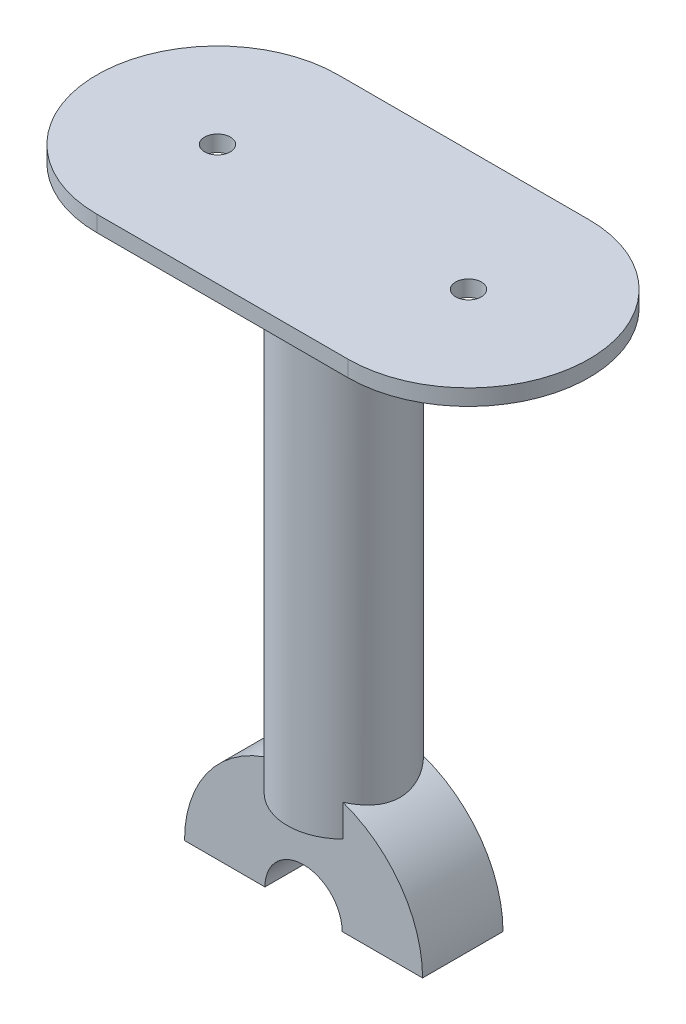
ISO-10303-21;
HEADER;
FILE_DESCRIPTION(('STEP AP214'),'2;1');
FILE_NAME('part.step','',(''),(''),'','','');
FILE_SCHEMA(('AUTOMOTIVE_DESIGN { 1 0 10303 214 1 1 1 1 }'));
ENDSEC;
DATA;
#1=APPLICATION_CONTEXT('core data for automotive mechanical design processes');
#2=APPLICATION_PROTOCOL_DEFINITION('international standard','automotive_design',2000,#1);
#3=PRODUCT_CONTEXT('',#1,'mechanical');
#4=PRODUCT('Part','Part','',(#3));
#5=PRODUCT_RELATED_PRODUCT_CATEGORY('part','',(#4));
#6=PRODUCT_DEFINITION_FORMATION('','',#4);
#7=PRODUCT_DEFINITION_CONTEXT('part definition',#1,'design');
#8=PRODUCT_DEFINITION('design','',#6,#7);
#9=PRODUCT_DEFINITION_SHAPE('','',#8);
#10=(LENGTH_UNIT() NAMED_UNIT(*) SI_UNIT(.MILLI.,.METRE.));
#11=(NAMED_UNIT(*) PLANE_ANGLE_UNIT() SI_UNIT($,.RADIAN.));
#12=(NAMED_UNIT(*) SI_UNIT($,.STERADIAN.) SOLID_ANGLE_UNIT());
#13=UNCERTAINTY_MEASURE_WITH_UNIT(LENGTH_MEASURE(1.E-05),#10,'distance_accuracy_value','');
#14=(GEOMETRIC_REPRESENTATION_CONTEXT(3) GLOBAL_UNCERTAINTY_ASSIGNED_CONTEXT((#13)) GLOBAL_UNIT_ASSIGNED_CONTEXT((#10,
#11,#12)) REPRESENTATION_CONTEXT('',''));
#15=CARTESIAN_POINT('',(0.,0.,0.));
#16=DIRECTION('',(0.,0.,1.));
#17=DIRECTION('',(1.,0.,0.));
#18=AXIS2_PLACEMENT_3D('',#15,#16,#17);
#19=CARTESIAN_POINT('',(0.,0.,3.3975023503956));
#20=DIRECTION('',(0.,0.,1.));
#21=DIRECTION('',(1.,0.,0.));
#22=AXIS2_PLACEMENT_3D('',#19,#20,#21);
#23=CYLINDRICAL_SURFACE('',#22,14.8);
#24=CARTESIAN_POINT('',(0.,14.8,-12.));
#25=CARTESIAN_POINT('',(-0.185259704840457,14.7999989630347,-11.9999988078874));
#26=CARTESIAN_POINT('',(-0.370549644482239,14.7965128172788,-11.9926363795848));
#27=CARTESIAN_POINT('',(-0.739780227980245,14.7826549803144,-11.9632644366915));
#28=CARTESIAN_POINT('',(-0.923720145121212,14.7722798214526,-11.9412475456179));
#29=CARTESIAN_POINT('',(-1.28910114819417,14.7448918264912,-11.8827685865555));
#30=CARTESIAN_POINT('',(-1.47053758174263,14.7278680058336,-11.8462826119881));
#31=CARTESIAN_POINT('',(-1.82937356041451,14.6876140820812,-11.7592525286429));
#32=CARTESIAN_POINT('',(-2.00677142159427,14.6643814397579,-11.708702667794));
#33=CARTESIAN_POINT('',(-2.35554842079048,14.6124040073616,-11.5943107568344));
#34=CARTESIAN_POINT('',(-2.52694967113428,14.5836827315042,-11.5305253135513));
#35=CARTESIAN_POINT('',(-2.86354637851544,14.5213435070958,-11.3900997622016));
#36=CARTESIAN_POINT('',(-3.02873944521919,14.4877236962773,-11.3134547636537));
#37=CARTESIAN_POINT('',(-3.35186725515679,14.4163912039918,-11.1480001335724));
#38=CARTESIAN_POINT('',(-3.5098062825915,14.3786809837213,-11.0591978087535));
#39=CARTESIAN_POINT('',(-3.81777509910112,14.2999966554203,-10.8700331437742));
#40=CARTESIAN_POINT('',(-3.96780197084138,14.2590213572953,-10.7696665825435));
#41=CARTESIAN_POINT('',(-4.42108547304645,14.1278535195382,-10.4404371870597));
#42=CARTESIAN_POINT('',(-4.70964202390827,14.0335008825378,-10.1925720917923));
#43=CARTESIAN_POINT('',(-5.24283721455753,13.8431588409943,-9.65365343628107));
#44=CARTESIAN_POINT('',(-5.48744611884268,13.7471683760043,-9.36257087598792));
#45=CARTESIAN_POINT('',(-5.82475173433462,13.6061938897523,-8.88760350986094));
#46=CARTESIAN_POINT('',(-5.93514734612753,13.5582725670511,-8.71691852029386));
#47=CARTESIAN_POINT('',(-6.14104637311898,13.4662634191195,-8.3658454378063));
#48=CARTESIAN_POINT('',(-6.23655599014154,13.4221740008407,-8.18546142806089));
#49=CARTESIAN_POINT('',(-6.41182410543168,13.3393371851367,-7.81607845411402));
#50=CARTESIAN_POINT('',(-6.49158683965586,13.3005883519278,-7.62708182361596));
#51=CARTESIAN_POINT('',(-6.63453517011881,13.2298643578488,-7.24168814298956));
#52=CARTESIAN_POINT('',(-6.69772240141591,13.1978885289289,-7.04529182497641));
#53=CARTESIAN_POINT('',(-6.80363014977447,13.1435899965697,-6.6578981416711));
#54=CARTESIAN_POINT('',(-6.84730684606449,13.1208232778415,-6.46722459989281));
#55=CARTESIAN_POINT('',(-6.91862500638124,13.0833580724292,-6.08211261486596));
#56=CARTESIAN_POINT('',(-6.94626708974332,13.0686592741237,-5.88767431733053));
#57=CARTESIAN_POINT('',(-6.98510508964963,13.0479421356164,-5.49683614394285));
#58=CARTESIAN_POINT('',(-6.99631248603065,13.0419177362905,-5.30043773389249));
#59=CARTESIAN_POINT('',(-7.00214572225295,13.0387871585309,-4.90733086862232));
#60=CARTESIAN_POINT('',(-6.99677286734342,13.0416802780822,-4.71062243902669));
#61=CARTESIAN_POINT('',(-6.97096031164226,13.0554926702048,-4.33919417542183));
#62=CARTESIAN_POINT('',(-6.9521542769814,13.0655413454779,-4.16432523842649));
#63=CARTESIAN_POINT('',(-6.90153548715552,13.0923500055375,-3.81694250570035));
#64=CARTESIAN_POINT('',(-6.86971837201076,13.1091122399819,-3.64442951948722));
#65=CARTESIAN_POINT('',(-6.79343463056445,13.1488056140694,-3.30298960068545));
#66=CARTESIAN_POINT('',(-6.74897022127037,13.1717356724857,-3.13406204516105));
#67=CARTESIAN_POINT('',(-6.64781516248701,13.2230771017056,-2.80070224333293));
#68=CARTESIAN_POINT('',(-6.59111974035983,13.2514906117379,-2.63627178013216));
#69=CARTESIAN_POINT('',(-6.46458165910964,13.313687033113,-2.30915837492915));
#70=CARTESIAN_POINT('',(-6.39446942641236,13.3475773221095,-2.1466001326302));
#71=CARTESIAN_POINT('',(-6.24252885164101,13.4193103288737,-1.8279310443375));
#72=CARTESIAN_POINT('',(-6.16069629259148,13.4571544679056,-1.67182254512356));
#73=CARTESIAN_POINT('',(-5.89845915900736,13.575158860251,-1.21427645218861));
#74=CARTESIAN_POINT('',(-5.70125153305051,13.6598236968513,-0.923455164811159));
#75=CARTESIAN_POINT('',(-5.24193138118177,13.8430376844787,-0.344519140329213));
#76=CARTESIAN_POINT('',(-4.97502570915163,13.9420804367857,-0.0603476578295819));
#77=CARTESIAN_POINT('',(-4.54160727118243,14.0867723595959,0.330268088341862));
#78=CARTESIAN_POINT('',(-4.39150615898713,14.1343900546379,0.454608664487689));
#79=CARTESIAN_POINT('',(-4.08098600740394,14.227148629405,0.690653850171055));
#80=CARTESIAN_POINT('',(-3.92057089935424,14.2722904408357,0.802363230017638));
#81=CARTESIAN_POINT('',(-3.58395625792121,14.3605947583672,1.01635617143752));
#82=CARTESIAN_POINT('',(-3.40738824743011,14.4036163996377,1.11811869917526));
#83=CARTESIAN_POINT('',(-3.04518362570229,14.4845181237175,1.30622499528433));
#84=CARTESIAN_POINT('',(-2.85955109139582,14.5224004895622,1.3925756155484));
#85=CARTESIAN_POINT('',(-2.48048120991425,14.5919268270289,1.54898746790261));
#86=CARTESIAN_POINT('',(-2.28704648066603,14.6235728705344,1.61905411138431));
#87=CARTESIAN_POINT('',(-1.89380541459821,14.6796774173357,1.74210143117157));
#88=CARTESIAN_POINT('',(-1.69399972612603,14.7041366494336,1.79508384001281));
#89=CARTESIAN_POINT('',(-1.30521960968256,14.7435275108898,1.87989090311255));
#90=CARTESIAN_POINT('',(-1.11658990190083,14.7590460289318,1.91302669572357));
#91=CARTESIAN_POINT('',(-0.736800389157911,14.7828723994646,1.96375046721015));
#92=CARTESIAN_POINT('',(-0.545640712884827,14.7911806172906,1.98133923383146));
#93=CARTESIAN_POINT('',(-0.162410266541905,14.8003496543467,2.00074443829371));
#94=CARTESIAN_POINT('',(0.0296601689564953,14.801213024033,2.0025662775699));
#95=CARTESIAN_POINT('',(0.413185719212609,14.7954740797575,1.99042795238675));
#96=CARTESIAN_POINT('',(0.604640855696791,14.788872032373,1.97646835145566));
#97=CARTESIAN_POINT('',(0.972420217459925,14.7690887268991,1.93442834038498));
#98=CARTESIAN_POINT('',(1.1488885326074,14.7563850561395,1.90737199417242));
#99=CARTESIAN_POINT('',(1.49878817928972,14.7249617250434,1.83998440742076));
#100=CARTESIAN_POINT('',(1.67221844894574,14.7062400037973,1.79964861915979));
#101=CARTESIAN_POINT('',(2.01480503443777,14.6632315243743,1.70612265973108));
#102=CARTESIAN_POINT('',(2.18396265700001,14.6389464911064,1.65293647256018));
#103=CARTESIAN_POINT('',(2.51711462852746,14.5853562784322,1.5341736113086));
#104=CARTESIAN_POINT('',(2.68110697506175,14.5560491797933,1.46859219927828));
#105=CARTESIAN_POINT('',(3.00780345594292,14.4921232525648,1.32344929361286));
#106=CARTESIAN_POINT('',(3.17032179681788,14.4573715910148,1.24352782376027));
#107=CARTESIAN_POINT('',(3.48804912220733,14.3840239497267,1.07175117127925));
#108=CARTESIAN_POINT('',(3.64325540167751,14.3454265634853,0.979891618749943));
#109=CARTESIAN_POINT('',(4.0967213269167,14.2251348800562,0.687370255837105));
#110=CARTESIAN_POINT('',(4.38300194347983,14.138905638486,0.469687926734008));
#111=CARTESIAN_POINT('',(4.94225095005662,13.9538036899958,-0.0274327139034795));
#112=CARTESIAN_POINT('',(5.21171346959498,13.8544910374497,-0.310661962509478));
#113=CARTESIAN_POINT('',(5.57824385907027,13.7091421904583,-0.766637573959796));
#114=CARTESIAN_POINT('',(5.69421902694836,13.6612600566409,-0.923952733700806));
#115=CARTESIAN_POINT('',(5.91290438663517,13.5680382465226,-1.24823236736146));
#116=CARTESIAN_POINT('',(6.01561967821008,13.5226975965824,-1.41519309560532));
#117=CARTESIAN_POINT('',(6.21048288197348,13.4343503020569,-1.76406895133246));
#118=CARTESIAN_POINT('',(6.30212015157853,13.3914855389934,-1.94630557738623));
#119=CARTESIAN_POINT('',(6.4694853232005,13.3114374021792,-2.31905462436036));
#120=CARTESIAN_POINT('',(6.54522081779358,13.2742513193684,-2.50956304309341));
#121=CARTESIAN_POINT('',(6.67993927484684,13.2069710941444,-2.89749230793815));
#122=CARTESIAN_POINT('',(6.73893386126238,13.1768720333819,-3.09490825033542));
#123=CARTESIAN_POINT('',(6.83945551613644,13.1249785084288,-3.49520290686643));
#124=CARTESIAN_POINT('',(6.88098492844879,13.1031829299348,-3.69808088409574));
#125=CARTESIAN_POINT('',(6.94298704812643,13.0704261310285,-4.08874111227443));
#126=CARTESIAN_POINT('',(6.96503875587765,13.0586560415743,-4.27620606638296));
#127=CARTESIAN_POINT('',(6.99392320526031,13.04320942762,-4.65263522990118));
#128=CARTESIAN_POINT('',(7.00075692046395,13.0395323853668,-4.84159934262585));
#129=CARTESIAN_POINT('',(6.99911023654371,13.0404162262943,-5.21938907412436));
#130=CARTESIAN_POINT('',(6.99063385236957,13.0449749497121,-5.4082147162204));
#131=CARTESIAN_POINT('',(6.95849384073578,13.0621473852668,-5.78419318444977));
#132=CARTESIAN_POINT('',(6.93483061754902,13.0747608829859,-5.97134605497774));
#133=CARTESIAN_POINT('',(6.87504100343548,13.1062905671937,-6.32814411931347));
#134=CARTESIAN_POINT('',(6.84001741008548,13.1246452102974,-6.4980257786748));
#135=CARTESIAN_POINT('',(6.75766781571394,13.1672348386201,-6.83408413898016));
#136=CARTESIAN_POINT('',(6.71033766550797,13.1914718068948,-7.00025956980447));
#137=CARTESIAN_POINT('',(6.60383646966391,13.2451082880741,-7.32787710765511));
#138=CARTESIAN_POINT('',(6.54466716670065,13.2745070411071,-7.4893199073003));
#139=CARTESIAN_POINT('',(6.41495012628098,13.3376766276556,-7.8067465222685));
#140=CARTESIAN_POINT('',(6.34439799972798,13.371449146654,-7.96272820349336));
#141=CARTESIAN_POINT('',(6.18739464300475,13.4448556643011,-8.27860988688189));
#142=CARTESIAN_POINT('',(6.10019956304822,13.4847297968752,-8.43808437361797));
#143=CARTESIAN_POINT('',(5.91403671000074,13.5674073973668,-8.74927444460269));
#144=CARTESIAN_POINT('',(5.81506491386426,13.6102118641833,-8.90098735196303));
#145=CARTESIAN_POINT('',(5.60593047666166,13.6976782829684,-9.19597901155181));
#146=CARTESIAN_POINT('',(5.49576522579768,13.7423406666773,-9.33925578450645));
#147=CARTESIAN_POINT('',(5.26482668901307,13.8324605410203,-9.61672889856401));
#148=CARTESIAN_POINT('',(5.14405272594405,13.8779180822602,-9.75092465906151));
#149=CARTESIAN_POINT('',(4.87930107808523,13.9733399221026,-10.0231601234033));
#150=CARTESIAN_POINT('',(4.7342174988006,14.0232787383807,-10.160135919027));
#151=CARTESIAN_POINT('',(4.43261818282592,14.1215098305543,-10.4214104513931));
#152=CARTESIAN_POINT('',(4.27610599952954,14.1698026114447,-10.5457130999231));
#153=CARTESIAN_POINT('',(3.9522872628702,14.263514893461,-10.7809609197232));
#154=CARTESIAN_POINT('',(3.78497071502903,14.3089316549661,-10.8918934431681));
#155=CARTESIAN_POINT('',(3.44069851295201,14.3955924522272,-11.0993410312224));
#156=CARTESIAN_POINT('',(3.26374735537594,14.4368384093278,-11.1958627442449));
#157=CARTESIAN_POINT('',(2.9017273737336,14.5139287938707,-11.3734221078129));
#158=CARTESIAN_POINT('',(2.71668226597695,14.5497877946334,-11.4545016992707));
#159=CARTESIAN_POINT('',(2.33937726051128,14.6151956972959,-11.6006222787515));
#160=CARTESIAN_POINT('',(2.14712093222852,14.6447476738377,-11.6656710841048));
#161=CARTESIAN_POINT('',(1.75723410973888,14.6966226401365,-11.7788821591968));
#162=CARTESIAN_POINT('',(1.55961707124085,14.7189621886985,-11.8270831307387));
#163=CARTESIAN_POINT('',(1.1603268997815,14.7558050682433,-11.9061577409497));
#164=CARTESIAN_POINT('',(0.958656504004277,14.770313514511,-11.9370426909755));
#165=CARTESIAN_POINT('',(0.63047291275654,14.7870990433377,-11.97269164032));
#166=CARTESIAN_POINT('',(0.504655240627097,14.7919310409209,-11.982926249091));
#167=CARTESIAN_POINT('',(0.252563069003192,14.7983819082822,-11.9965809107315));
#168=CARTESIAN_POINT('',(0.126288559451097,14.8000007068825,-12.0000008126439));
#169=CARTESIAN_POINT('',(0.,14.8,-12.));
#170=B_SPLINE_CURVE_WITH_KNOTS('',3,(#24,#25,#26,#27,#28,#29,#30,#31,#32,#33,#34,#35,#36,#37,
#38,#39,#40,#41,#42,#43,#44,#45,#46,#47,#48,#49,#50,#51,#52,#53,#54,#55,#56,#57,#58,#59,#60,#61,
#62,#63,#64,#65,#66,#67,#68,#69,#70,#71,#72,#73,#74,#75,#76,#77,#78,#79,#80,#81,#82,#83,#84,#85,
#86,#87,#88,#89,#90,#91,#92,#93,#94,#95,#96,#97,#98,#99,#100,#101,#102,#103,#104,#105,#106,#107,
#108,#109,#110,#111,#112,#113,#114,#115,#116,#117,#118,#119,#120,#121,#122,#123,#124,#125,#126,
#127,#128,#129,#130,#131,#132,#133,#134,#135,#136,#137,#138,#139,#140,#141,#142,#143,#144,#145,
#146,#147,#148,#149,#150,#151,#152,#153,#154,#155,#156,#157,#158,#159,#160,#161,#162,#163,#164,
#165,#166,#167,#168,#169),.UNSPECIFIED.,.T.,.F.,(4,2,2,2,2,2,2,2,2,2,2,2,2,2,2,2,2,2,2,2,2,2,2,
2,2,2,2,2,2,2,2,2,2,2,2,2,2,2,2,2,2,2,2,2,2,2,2,2,2,2,2,2,2,2,2,2,2,2,2,2,2,2,2,2,2,2,2,2,2,2,2,
2,4),(0.,0.555653644236237,1.11158719450167,1.66844314012858,2.22552717317717,2.78027600482328,
3.3352362873134,3.88986448370473,4.44469577053497,5.61519536388487,6.78648397292003,
7.41235459672639,8.03796376838415,8.66340441938316,9.28878335178282,9.87875703869294,
10.4687079364092,11.0582465493403,11.6477387531342,12.1756105314892,12.7036593434638,
13.2316156481061,13.759778339308,14.2999476041843,14.8403117125926,15.9205113517519,
17.1215668599687,17.7229489662715,18.3241031900843,18.9481530681069,19.5719248084563,
20.1954889634504,20.8189898620455,21.3946668894981,21.9703147465396,22.5457653902816,
23.1211954863132,23.6575214920403,24.1940313611466,24.7303751095676,25.2669242861122,
25.8195484200912,26.3723754133305,27.4774544654412,28.6818012682303,29.2849147333809,
29.887795544805,30.5122825735509,31.1364707487339,31.7602244559327,32.38389442767,
32.9504982954883,33.5170659137405,34.0834849757888,34.6498889604158,35.1725801935821,
35.6954478823444,36.2182386636667,36.7412315114921,37.2988879577733,37.8567354550276,
38.414713316377,38.9727268190694,39.5890561690349,40.2051946985576,40.8219115805929,
41.4383430558261,42.0530756471418,42.6675078714609,43.2805192379977,43.8931296987445,
44.2719014556948,44.6506816029739),.UNSPECIFIED.);
#171=CARTESIAN_POINT('',(-4.89897948556636,13.9656722000769,-10.));
#172=VERTEX_POINT('',#171);
#173=CARTESIAN_POINT('',(-4.89897948556636,13.9656722000769,0.));
#174=VERTEX_POINT('',#173);
#175=EDGE_CURVE('E199',#172,#174,#170,.T.);
#176=ORIENTED_EDGE('',*,*,#175,.F.);
#177=CARTESIAN_POINT('',(0.,0.,-10.));
#178=DIRECTION('',(0.,0.,1.));
#179=DIRECTION('',(1.,0.,0.));
#180=AXIS2_PLACEMENT_3D('',#177,#178,#179);
#181=CIRCLE('',#180,14.8);
#182=CARTESIAN_POINT('',(-14.8,0.,-10.));
#183=VERTEX_POINT('',#182);
#184=EDGE_CURVE('E277',#172,#183,#181,.T.);
#185=ORIENTED_EDGE('',*,*,#184,.T.);
#186=DIRECTION('',(0.,0.,1.));
#187=VECTOR('',#186,1.);
#188=CARTESIAN_POINT('',(-14.8,0.,0.));
#189=LINE('',#188,#187);
#190=CARTESIAN_POINT('',(-14.8,0.,0.));
#191=VERTEX_POINT('',#190);
#192=EDGE_CURVE('E248',#183,#191,#189,.T.);
#193=ORIENTED_EDGE('',*,*,#192,.T.);
#194=CARTESIAN_POINT('',(0.,0.,0.));
#195=DIRECTION('',(0.,0.,1.));
#196=DIRECTION('',(1.,0.,0.));
#197=AXIS2_PLACEMENT_3D('',#194,#195,#196);
#198=CIRCLE('',#197,14.8);
#199=EDGE_CURVE('E285',#174,#191,#198,.T.);
#200=ORIENTED_EDGE('',*,*,#199,.F.);
#201=EDGE_LOOP('',(#176,#185,#193,#200));
#202=FACE_BOUND('',#201,.T.);
#203=ADVANCED_FACE('F46',(#202),#23,.T.);
#204=CARTESIAN_POINT('',(4.89897948556636,13.9656722000769,0.));
#205=VERTEX_POINT('',#204);
#206=CARTESIAN_POINT('',(4.89897948556636,13.9656722000769,-10.));
#207=VERTEX_POINT('',#206);
#208=EDGE_CURVE('E189',#205,#207,#170,.T.);
#209=ORIENTED_EDGE('',*,*,#208,.F.);
#210=CARTESIAN_POINT('',(14.8,-2.21653213133813E-13,0.));
#211=VERTEX_POINT('',#210);
#212=EDGE_CURVE('E286',#211,#205,#198,.T.);
#213=ORIENTED_EDGE('',*,*,#212,.F.);
#214=DIRECTION('',(0.,0.,1.));
#215=VECTOR('',#214,1.);
#216=CARTESIAN_POINT('',(14.8,-2.21653213133813E-13,0.));
#217=LINE('',#216,#215);
#218=CARTESIAN_POINT('',(14.8,-2.21653213133813E-13,-10.));
#219=VERTEX_POINT('',#218);
#220=EDGE_CURVE('E265',#219,#211,#217,.T.);
#221=ORIENTED_EDGE('',*,*,#220,.F.);
#222=EDGE_CURVE('E278',#219,#207,#181,.T.);
#223=ORIENTED_EDGE('',*,*,#222,.T.);
#224=EDGE_LOOP('',(#209,#213,#221,#223));
#225=FACE_BOUND('',#224,.T.);
#226=ADVANCED_FACE('F231',(#225),#23,.T.);
#227=CARTESIAN_POINT('',(4.8,0.,0.));
#228=DIRECTION('',(0.,0.,-1.));
#229=DIRECTION('',(-1.,0.,0.));
#230=AXIS2_PLACEMENT_3D('',#227,#228,#229);
#231=PLANE('',#230);
#232=DIRECTION('',(0.,-1.,0.));
#233=VECTOR('',#232,1.);
#234=CARTESIAN_POINT('',(4.89897948556636,70.,0.));
#235=LINE('',#234,#233);
#236=CARTESIAN_POINT('',(4.89897948556636,10.,0.));
#237=VERTEX_POINT('',#236);
#238=EDGE_CURVE('E68',#237,#205,#235,.F.);
#239=ORIENTED_EDGE('',*,*,#238,.F.);
#240=DIRECTION('',(1.,0.,0.));
#241=VECTOR('',#240,1.);
#242=CARTESIAN_POINT('',(4.8,10.,0.));
#243=LINE('',#242,#241);
#244=CARTESIAN_POINT('',(-4.89897948556636,10.,0.));
#245=VERTEX_POINT('',#244);
#246=EDGE_CURVE('E72',#245,#237,#243,.T.);
#247=ORIENTED_EDGE('',*,*,#246,.F.);
#248=DIRECTION('',(0.,-1.,0.));
#249=VECTOR('',#248,1.);
#250=CARTESIAN_POINT('',(-4.89897948556636,70.,0.));
#251=LINE('',#250,#249);
#252=EDGE_CURVE('E252',#174,#245,#251,.T.);
#253=ORIENTED_EDGE('',*,*,#252,.F.);
#254=ORIENTED_EDGE('',*,*,#199,.T.);
#255=DIRECTION('',(1.,0.,0.));
#256=VECTOR('',#255,1.);
#257=CARTESIAN_POINT('',(-4.8,0.,0.));
#258=LINE('',#257,#256);
#259=CARTESIAN_POINT('',(-4.8,0.,0.));
#260=VERTEX_POINT('',#259);
#261=EDGE_CURVE('E250',#191,#260,#258,.T.);
#262=ORIENTED_EDGE('',*,*,#261,.T.);
#263=CARTESIAN_POINT('',(0.,0.,0.));
#264=DIRECTION('',(0.,0.,1.));
#265=DIRECTION('',(1.,0.,0.));
#266=AXIS2_PLACEMENT_3D('',#263,#264,#265);
#267=CIRCLE('',#266,4.8);
#268=CARTESIAN_POINT('',(4.8,0.,0.));
#269=VERTEX_POINT('',#268);
#270=EDGE_CURVE('E283',#269,#260,#267,.T.);
#271=ORIENTED_EDGE('',*,*,#270,.F.);
#272=DIRECTION('',(-1.,0.,0.));
#273=VECTOR('',#272,1.);
#274=CARTESIAN_POINT('',(4.8,0.,0.));
#275=LINE('',#274,#273);
#276=EDGE_CURVE('E268',#211,#269,#275,.T.);
#277=ORIENTED_EDGE('',*,*,#276,.F.);
#278=ORIENTED_EDGE('',*,*,#212,.T.);
#279=EDGE_LOOP('',(#239,#247,#253,#254,#262,#271,#277,#278));
#280=FACE_BOUND('',#279,.T.);
#281=ADVANCED_FACE('F48',(#280),#231,.F.);
#282=CARTESIAN_POINT('',(4.8,0.,-10.));
#283=DIRECTION('',(0.,0.,1.));
#284=DIRECTION('',(1.,0.,0.));
#285=AXIS2_PLACEMENT_3D('',#282,#283,#284);
#286=PLANE('',#285);
#287=DIRECTION('',(0.,-1.,0.));
#288=VECTOR('',#287,1.);
#289=CARTESIAN_POINT('',(-4.89897948556636,70.,-10.));
#290=LINE('',#289,#288);
#291=CARTESIAN_POINT('',(-4.89897948556636,10.,-10.));
#292=VERTEX_POINT('',#291);
#293=EDGE_CURVE('E11',#292,#172,#290,.F.);
#294=ORIENTED_EDGE('',*,*,#293,.F.);
#295=DIRECTION('',(-1.,0.,0.));
#296=VECTOR('',#295,1.);
#297=CARTESIAN_POINT('',(4.8,10.,-10.));
#298=LINE('',#297,#296);
#299=CARTESIAN_POINT('',(4.89897948556636,10.,-10.));
#300=VERTEX_POINT('',#299);
#301=EDGE_CURVE('E61',#300,#292,#298,.T.);
#302=ORIENTED_EDGE('',*,*,#301,.F.);
#303=DIRECTION('',(0.,-1.,0.));
#304=VECTOR('',#303,1.);
#305=CARTESIAN_POINT('',(4.89897948556636,70.,-10.));
#306=LINE('',#305,#304);
#307=EDGE_CURVE('E288',#207,#300,#306,.T.);
#308=ORIENTED_EDGE('',*,*,#307,.F.);
#309=ORIENTED_EDGE('',*,*,#222,.F.);
#310=DIRECTION('',(1.,0.,0.));
#311=VECTOR('',#310,1.);
#312=CARTESIAN_POINT('',(4.8,0.,-10.));
#313=LINE('',#312,#311);
#314=CARTESIAN_POINT('',(4.8,0.,-10.));
#315=VERTEX_POINT('',#314);
#316=EDGE_CURVE('E274',#315,#219,#313,.T.);
#317=ORIENTED_EDGE('',*,*,#316,.F.);
#318=CARTESIAN_POINT('',(0.,0.,-10.));
#319=DIRECTION('',(0.,0.,1.));
#320=DIRECTION('',(1.,0.,0.));
#321=AXIS2_PLACEMENT_3D('',#318,#319,#320);
#322=CIRCLE('',#321,4.8);
#323=CARTESIAN_POINT('',(-4.8,0.,-10.));
#324=VERTEX_POINT('',#323);
#325=EDGE_CURVE('E281',#315,#324,#322,.T.);
#326=ORIENTED_EDGE('',*,*,#325,.T.);
#327=DIRECTION('',(-1.,0.,0.));
#328=VECTOR('',#327,1.);
#329=CARTESIAN_POINT('',(-4.8,0.,-10.));
#330=LINE('',#329,#328);
#331=EDGE_CURVE('E262',#324,#183,#330,.T.);
#332=ORIENTED_EDGE('',*,*,#331,.T.);
#333=ORIENTED_EDGE('',*,*,#184,.F.);
#334=EDGE_LOOP('',(#294,#302,#308,#309,#317,#326,#332,#333));
#335=FACE_BOUND('',#334,.T.);
#336=ADVANCED_FACE('F226',(#335),#286,.F.);
#337=CARTESIAN_POINT('',(0.,0.,3.3975023503956));
#338=DIRECTION('',(0.,0.,1.));
#339=DIRECTION('',(1.,0.,0.));
#340=AXIS2_PLACEMENT_3D('',#337,#338,#339);
#341=CYLINDRICAL_SURFACE('',#340,4.8);
#342=ORIENTED_EDGE('',*,*,#325,.F.);
#343=DIRECTION('',(0.,0.,-1.));
#344=VECTOR('',#343,1.);
#345=CARTESIAN_POINT('',(4.8,0.,-10.));
#346=LINE('',#345,#344);
#347=EDGE_CURVE('E271',#269,#315,#346,.T.);
#348=ORIENTED_EDGE('',*,*,#347,.F.);
#349=ORIENTED_EDGE('',*,*,#270,.T.);
#350=DIRECTION('',(0.,0.,-1.));
#351=VECTOR('',#350,1.);
#352=CARTESIAN_POINT('',(-4.8,0.,-10.));
#353=LINE('',#352,#351);
#354=EDGE_CURVE('E259',#260,#324,#353,.T.);
#355=ORIENTED_EDGE('',*,*,#354,.T.);
#356=EDGE_LOOP('',(#342,#348,#349,#355));
#357=FACE_BOUND('',#356,.T.);
#358=ADVANCED_FACE('F219',(#357),#341,.F.);
#359=CARTESIAN_POINT('',(0.,0.,0.));
#360=DIRECTION('',(0.,-1.,0.));
#361=DIRECTION('',(0.,0.,1.));
#362=AXIS2_PLACEMENT_3D('',#359,#360,#361);
#363=PLANE('',#362);
#364=CARTESIAN_POINT('',(9.8,-1.46770370858876E-13,-5.));
#365=DIRECTION('',(0.,-1.,0.));
#366=DIRECTION('',(1.,0.,0.));
#367=AXIS2_PLACEMENT_3D('',#364,#365,#366);
#368=CIRCLE('',#367,2.1);
#369=CARTESIAN_POINT('',(11.9,-1.7822116461435E-13,-5.));
#370=VERTEX_POINT('',#369);
#371=EDGE_CURVE('E177',#370,#370,#368,.T.);
#372=ORIENTED_EDGE('',*,*,#371,.F.);
#373=EDGE_LOOP('',(#372));
#374=FACE_BOUND('',#373,.T.);
#375=ORIENTED_EDGE('',*,*,#220,.T.);
#376=ORIENTED_EDGE('',*,*,#276,.T.);
#377=ORIENTED_EDGE('',*,*,#347,.T.);
#378=ORIENTED_EDGE('',*,*,#316,.T.);
#379=EDGE_LOOP('',(#375,#376,#377,#378));
#380=FACE_BOUND('',#379,.T.);
#381=ADVANCED_FACE('F216',(#374,#380),#363,.T.);
#382=CARTESIAN_POINT('',(0.,0.,0.));
#383=DIRECTION('',(0.,1.,0.));
#384=DIRECTION('',(0.,0.,1.));
#385=AXIS2_PLACEMENT_3D('',#382,#383,#384);
#386=PLANE('',#385);
#387=CARTESIAN_POINT('',(-9.8,0.,-5.));
#388=DIRECTION('',(0.,-1.,0.));
#389=DIRECTION('',(0.,0.,-1.));
#390=AXIS2_PLACEMENT_3D('',#387,#388,#389);
#391=CIRCLE('',#390,2.1);
#392=CARTESIAN_POINT('',(-9.8,0.,-7.1));
#393=VERTEX_POINT('',#392);
#394=EDGE_CURVE('E168',#393,#393,#391,.T.);
#395=ORIENTED_EDGE('',*,*,#394,.F.);
#396=EDGE_LOOP('',(#395));
#397=FACE_BOUND('',#396,.T.);
#398=ORIENTED_EDGE('',*,*,#192,.F.);
#399=ORIENTED_EDGE('',*,*,#331,.F.);
#400=ORIENTED_EDGE('',*,*,#354,.F.);
#401=ORIENTED_EDGE('',*,*,#261,.F.);
#402=EDGE_LOOP('',(#398,#399,#400,#401));
#403=FACE_BOUND('',#402,.T.);
#404=ADVANCED_FACE('F214',(#397,#403),#386,.F.);
#405=CARTESIAN_POINT('',(0.,10.,-5.));
#406=DIRECTION('',(0.,1.,0.));
#407=DIRECTION('',(0.,0.,1.));
#408=AXIS2_PLACEMENT_3D('',#405,#406,#407);
#409=PLANE('',#408);
#410=CARTESIAN_POINT('',(0.,10.,-5.));
#411=DIRECTION('',(0.,1.,0.));
#412=DIRECTION('',(0.,0.,1.));
#413=AXIS2_PLACEMENT_3D('',#410,#411,#412);
#414=CIRCLE('',#413,7.);
#415=EDGE_CURVE('E183',#245,#237,#414,.T.);
#416=ORIENTED_EDGE('',*,*,#415,.F.);
#417=ORIENTED_EDGE('',*,*,#246,.T.);
#418=EDGE_LOOP('',(#416,#417));
#419=FACE_BOUND('',#418,.T.);
#420=ADVANCED_FACE('F213',(#419),#409,.F.);
#421=EDGE_CURVE('E190',#300,#292,#414,.T.);
#422=ORIENTED_EDGE('',*,*,#421,.F.);
#423=ORIENTED_EDGE('',*,*,#301,.T.);
#424=EDGE_LOOP('',(#422,#423));
#425=FACE_BOUND('',#424,.T.);
#426=ADVANCED_FACE('F211',(#425),#409,.F.);
#427=CARTESIAN_POINT('',(0.,70.,-5.));
#428=DIRECTION('',(0.,-1.,0.));
#429=DIRECTION('',(0.,0.,-1.));
#430=AXIS2_PLACEMENT_3D('',#427,#428,#429);
#431=CYLINDRICAL_SURFACE('',#430,7.);
#432=CARTESIAN_POINT('',(0.,70.,-5.));
#433=DIRECTION('',(0.,1.,0.));
#434=DIRECTION('',(0.,0.,1.));
#435=AXIS2_PLACEMENT_3D('',#432,#433,#434);
#436=CIRCLE('',#435,7.);
#437=CARTESIAN_POINT('',(0.,70.,2.));
#438=VERTEX_POINT('',#437);
#439=EDGE_CURVE('E186',#438,#438,#436,.T.);
#440=ORIENTED_EDGE('',*,*,#439,.F.);
#441=EDGE_LOOP('',(#440));
#442=FACE_BOUND('',#441,.T.);
#443=ORIENTED_EDGE('',*,*,#175,.T.);
#444=ORIENTED_EDGE('',*,*,#252,.T.);
#445=ORIENTED_EDGE('',*,*,#415,.T.);
#446=ORIENTED_EDGE('',*,*,#238,.T.);
#447=ORIENTED_EDGE('',*,*,#208,.T.);
#448=ORIENTED_EDGE('',*,*,#307,.T.);
#449=ORIENTED_EDGE('',*,*,#421,.T.);
#450=ORIENTED_EDGE('',*,*,#293,.T.);
#451=EDGE_LOOP('',(#443,#444,#445,#446,#447,#448,#449,#450));
#452=FACE_BOUND('',#451,.T.);
#453=ADVANCED_FACE('F205',(#442,#452),#431,.T.);
#454=CARTESIAN_POINT('',(9.80000000000009,5.99999999999985,-5.));
#455=DIRECTION('',(0.,-1.,0.));
#456=DIRECTION('',(1.,0.,0.));
#457=AXIS2_PLACEMENT_3D('',#454,#455,#456);
#458=CYLINDRICAL_SURFACE('',#457,2.1);
#459=CARTESIAN_POINT('',(9.80000000000009,5.99999999999985,-5.));
#460=DIRECTION('',(0.,-1.,0.));
#461=DIRECTION('',(1.,0.,0.));
#462=AXIS2_PLACEMENT_3D('',#459,#460,#461);
#463=CIRCLE('',#462,2.1);
#464=CARTESIAN_POINT('',(11.9000000000001,5.99999999999982,-5.));
#465=VERTEX_POINT('',#464);
#466=EDGE_CURVE('E180',#465,#465,#463,.T.);
#467=ORIENTED_EDGE('',*,*,#466,.F.);
#468=EDGE_LOOP('',(#467));
#469=FACE_BOUND('',#468,.T.);
#470=ORIENTED_EDGE('',*,*,#371,.T.);
#471=EDGE_LOOP('',(#470));
#472=FACE_BOUND('',#471,.T.);
#473=ADVANCED_FACE('F210',(#469,#472),#458,.F.);
#474=CARTESIAN_POINT('',(9.80000000000009,5.99999999999985,-5.));
#475=DIRECTION('',(0.,-1.,0.));
#476=DIRECTION('',(1.,0.,0.));
#477=AXIS2_PLACEMENT_3D('',#474,#475,#476);
#478=PLANE('',#477);
#479=ORIENTED_EDGE('',*,*,#466,.T.);
#480=EDGE_LOOP('',(#479));
#481=FACE_BOUND('',#480,.T.);
#482=ADVANCED_FACE('F329',(#481),#478,.T.);
#483=CARTESIAN_POINT('',(-9.8,6.,-5.));
#484=DIRECTION('',(0.,-1.,0.));
#485=DIRECTION('',(0.,0.,-1.));
#486=AXIS2_PLACEMENT_3D('',#483,#484,#485);
#487=CYLINDRICAL_SURFACE('',#486,2.1);
#488=CARTESIAN_POINT('',(-9.8,6.,-5.));
#489=DIRECTION('',(0.,-1.,0.));
#490=DIRECTION('',(0.,0.,-1.));
#491=AXIS2_PLACEMENT_3D('',#488,#489,#490);
#492=CIRCLE('',#491,2.1);
#493=CARTESIAN_POINT('',(-9.8,6.,-7.1));
#494=VERTEX_POINT('',#493);
#495=EDGE_CURVE('E174',#494,#494,#492,.T.);
#496=ORIENTED_EDGE('',*,*,#495,.F.);
#497=EDGE_LOOP('',(#496));
#498=FACE_BOUND('',#497,.T.);
#499=ORIENTED_EDGE('',*,*,#394,.T.);
#500=EDGE_LOOP('',(#499));
#501=FACE_BOUND('',#500,.T.);
#502=ADVANCED_FACE('F339',(#498,#501),#487,.F.);
#503=CARTESIAN_POINT('',(-9.8,6.,-5.));
#504=DIRECTION('',(0.,-1.,0.));
#505=DIRECTION('',(0.,0.,-1.));
#506=AXIS2_PLACEMENT_3D('',#503,#504,#505);
#507=PLANE('',#506);
#508=ORIENTED_EDGE('',*,*,#495,.T.);
#509=EDGE_LOOP('',(#508));
#510=FACE_BOUND('',#509,.T.);
#511=ADVANCED_FACE('F349',(#510),#507,.T.);
#512=CARTESIAN_POINT('',(-15.6999351585227,72.,-5.));
#513=DIRECTION('',(0.,-1.,0.));
#514=DIRECTION('',(0.,0.,-1.));
#515=AXIS2_PLACEMENT_3D('',#512,#513,#514);
#516=CYLINDRICAL_SURFACE('',#515,15.);
#517=CARTESIAN_POINT('',(-15.6999351585227,70.,-5.));
#518=DIRECTION('',(0.,1.,0.));
#519=DIRECTION('',(0.,0.,1.));
#520=AXIS2_PLACEMENT_3D('',#517,#518,#519);
#521=CIRCLE('',#520,15.);
#522=CARTESIAN_POINT('',(-15.6999351585227,70.,-20.));
#523=VERTEX_POINT('',#522);
#524=CARTESIAN_POINT('',(-15.6999351585227,70.,10.));
#525=VERTEX_POINT('',#524);
#526=EDGE_CURVE('E164',#523,#525,#521,.T.);
#527=ORIENTED_EDGE('',*,*,#526,.T.);
#528=DIRECTION('',(0.,-1.,0.));
#529=VECTOR('',#528,1.);
#530=CARTESIAN_POINT('',(-15.6999351585227,72.,10.));
#531=LINE('',#530,#529);
#532=CARTESIAN_POINT('',(-15.6999351585227,72.,10.));
#533=VERTEX_POINT('',#532);
#534=EDGE_CURVE('E145',#533,#525,#531,.T.);
#535=ORIENTED_EDGE('',*,*,#534,.F.);
#536=CARTESIAN_POINT('',(-15.6999351585227,72.,-5.));
#537=DIRECTION('',(0.,1.,0.));
#538=DIRECTION('',(0.,0.,1.));
#539=AXIS2_PLACEMENT_3D('',#536,#537,#538);
#540=CIRCLE('',#539,15.);
#541=CARTESIAN_POINT('',(-15.6999351585227,72.,-20.));
#542=VERTEX_POINT('',#541);
#543=EDGE_CURVE('E152',#542,#533,#540,.T.);
#544=ORIENTED_EDGE('',*,*,#543,.F.);
#545=DIRECTION('',(0.,-1.,0.));
#546=VECTOR('',#545,1.);
#547=CARTESIAN_POINT('',(-15.6999351585227,72.,-20.));
#548=LINE('',#547,#546);
#549=EDGE_CURVE('E464',#542,#523,#548,.T.);
#550=ORIENTED_EDGE('',*,*,#549,.T.);
#551=EDGE_LOOP('',(#527,#535,#544,#550));
#552=FACE_BOUND('',#551,.T.);
#553=ADVANCED_FACE('F162',(#552),#516,.T.);
#554=CARTESIAN_POINT('',(-15.6999351585227,72.,10.));
#555=DIRECTION('',(0.,0.,-1.));
#556=DIRECTION('',(-1.,0.,0.));
#557=AXIS2_PLACEMENT_3D('',#554,#555,#556);
#558=PLANE('',#557);
#559=DIRECTION('',(1.,0.,0.));
#560=VECTOR('',#559,1.);
#561=CARTESIAN_POINT('',(-15.6999351585227,70.,10.));
#562=LINE('',#561,#560);
#563=CARTESIAN_POINT('',(15.5113968595733,70.,10.));
#564=VERTEX_POINT('',#563);
#565=EDGE_CURVE('E466',#525,#564,#562,.T.);
#566=ORIENTED_EDGE('',*,*,#565,.T.);
#567=DIRECTION('',(0.,-1.,0.));
#568=VECTOR('',#567,1.);
#569=CARTESIAN_POINT('',(15.5113968595733,72.,10.));
#570=LINE('',#569,#568);
#571=CARTESIAN_POINT('',(15.5113968595733,72.,10.));
#572=VERTEX_POINT('',#571);
#573=EDGE_CURVE('E148',#572,#564,#570,.T.);
#574=ORIENTED_EDGE('',*,*,#573,.F.);
#575=DIRECTION('',(1.,0.,0.));
#576=VECTOR('',#575,1.);
#577=CARTESIAN_POINT('',(-15.6999351585227,72.,10.));
#578=LINE('',#577,#576);
#579=EDGE_CURVE('E141',#533,#572,#578,.T.);
#580=ORIENTED_EDGE('',*,*,#579,.F.);
#581=ORIENTED_EDGE('',*,*,#534,.T.);
#582=EDGE_LOOP('',(#566,#574,#580,#581));
#583=FACE_BOUND('',#582,.T.);
#584=ADVANCED_FACE('F143',(#583),#558,.F.);
#585=CARTESIAN_POINT('',(15.5113968595733,72.,-5.));
#586=DIRECTION('',(0.,-1.,0.));
#587=DIRECTION('',(0.,0.,-1.));
#588=AXIS2_PLACEMENT_3D('',#585,#586,#587);
#589=CYLINDRICAL_SURFACE('',#588,15.);
#590=CARTESIAN_POINT('',(15.5113968595733,70.,-5.));
#591=DIRECTION('',(0.,1.,0.));
#592=DIRECTION('',(0.,0.,1.));
#593=AXIS2_PLACEMENT_3D('',#590,#591,#592);
#594=CIRCLE('',#593,15.);
#595=CARTESIAN_POINT('',(15.5113968595733,70.,-20.));
#596=VERTEX_POINT('',#595);
#597=EDGE_CURVE('E468',#564,#596,#594,.T.);
#598=ORIENTED_EDGE('',*,*,#597,.T.);
#599=DIRECTION('',(0.,-1.,0.));
#600=VECTOR('',#599,1.);
#601=CARTESIAN_POINT('',(15.5113968595733,72.,-20.));
#602=LINE('',#601,#600);
#603=CARTESIAN_POINT('',(15.5113968595733,72.,-20.));
#604=VERTEX_POINT('',#603);
#605=EDGE_CURVE('E170',#604,#596,#602,.T.);
#606=ORIENTED_EDGE('',*,*,#605,.F.);
#607=CARTESIAN_POINT('',(15.5113968595733,72.,-5.));
#608=DIRECTION('',(0.,1.,0.));
#609=DIRECTION('',(0.,0.,1.));
#610=AXIS2_PLACEMENT_3D('',#607,#608,#609);
#611=CIRCLE('',#610,15.);
#612=EDGE_CURVE('E151',#572,#604,#611,.T.);
#613=ORIENTED_EDGE('',*,*,#612,.F.);
#614=ORIENTED_EDGE('',*,*,#573,.T.);
#615=EDGE_LOOP('',(#598,#606,#613,#614));
#616=FACE_BOUND('',#615,.T.);
#617=ADVANCED_FACE('F376',(#616),#589,.T.);
#618=CARTESIAN_POINT('',(-15.6999351585227,72.,-20.));
#619=DIRECTION('',(0.,0.,-1.));
#620=DIRECTION('',(-1.,0.,0.));
#621=AXIS2_PLACEMENT_3D('',#618,#619,#620);
#622=PLANE('',#621);
#623=DIRECTION('',(1.,0.,0.));
#624=VECTOR('',#623,1.);
#625=CARTESIAN_POINT('',(-15.6999351585227,70.,-20.));
#626=LINE('',#625,#624);
#627=EDGE_CURVE('E160',#523,#596,#626,.T.);
#628=ORIENTED_EDGE('',*,*,#627,.F.);
#629=ORIENTED_EDGE('',*,*,#549,.F.);
#630=DIRECTION('',(1.,0.,0.));
#631=VECTOR('',#630,1.);
#632=CARTESIAN_POINT('',(-15.6999351585227,72.,-20.));
#633=LINE('',#632,#631);
#634=EDGE_CURVE('E158',#542,#604,#633,.T.);
#635=ORIENTED_EDGE('',*,*,#634,.T.);
#636=ORIENTED_EDGE('',*,*,#605,.T.);
#637=EDGE_LOOP('',(#628,#629,#635,#636));
#638=FACE_BOUND('',#637,.T.);
#639=ADVANCED_FACE('F385',(#638),#622,.T.);
#640=CARTESIAN_POINT('',(-15.6999351585227,72.,-5.));
#641=DIRECTION('',(0.,1.,0.));
#642=DIRECTION('',(0.,0.,1.));
#643=AXIS2_PLACEMENT_3D('',#640,#641,#642);
#644=PLANE('',#643);
#645=CARTESIAN_POINT('',(-15.6999351585227,72.,-5.));
#646=DIRECTION('',(0.,1.,0.));
#647=DIRECTION('',(0.,0.,1.));
#648=AXIS2_PLACEMENT_3D('',#645,#646,#647);
#649=CIRCLE('',#648,1.6);
#650=CARTESIAN_POINT('',(-15.6999351585227,72.,-3.4));
#651=VERTEX_POINT('',#650);
#652=EDGE_CURVE('E452',#651,#651,#649,.T.);
#653=ORIENTED_EDGE('',*,*,#652,.F.);
#654=EDGE_LOOP('',(#653));
#655=FACE_BOUND('',#654,.T.);
#656=CARTESIAN_POINT('',(15.5113968595733,72.,-5.));
#657=DIRECTION('',(0.,1.,0.));
#658=DIRECTION('',(0.,0.,1.));
#659=AXIS2_PLACEMENT_3D('',#656,#657,#658);
#660=CIRCLE('',#659,1.6);
#661=CARTESIAN_POINT('',(15.5113968595733,72.,-3.4));
#662=VERTEX_POINT('',#661);
#663=EDGE_CURVE('E453',#662,#662,#660,.T.);
#664=ORIENTED_EDGE('',*,*,#663,.F.);
#665=EDGE_LOOP('',(#664));
#666=FACE_BOUND('',#665,.T.);
#667=ORIENTED_EDGE('',*,*,#543,.T.);
#668=ORIENTED_EDGE('',*,*,#579,.T.);
#669=ORIENTED_EDGE('',*,*,#612,.T.);
#670=ORIENTED_EDGE('',*,*,#634,.F.);
#671=EDGE_LOOP('',(#667,#668,#669,#670));
#672=FACE_BOUND('',#671,.T.);
#673=ADVANCED_FACE('F156',(#655,#666,#672),#644,.T.);
#674=CARTESIAN_POINT('',(-15.6999351585227,70.,-5.));
#675=DIRECTION('',(0.,1.,0.));
#676=DIRECTION('',(0.,0.,1.));
#677=AXIS2_PLACEMENT_3D('',#674,#675,#676);
#678=PLANE('',#677);
#679=CARTESIAN_POINT('',(-15.6999351585227,70.,-5.));
#680=DIRECTION('',(0.,1.,0.));
#681=DIRECTION('',(0.,0.,1.));
#682=AXIS2_PLACEMENT_3D('',#679,#680,#681);
#683=CIRCLE('',#682,1.6);
#684=CARTESIAN_POINT('',(-15.6999351585227,70.,-3.4));
#685=VERTEX_POINT('',#684);
#686=EDGE_CURVE('E449',#685,#685,#683,.T.);
#687=ORIENTED_EDGE('',*,*,#686,.T.);
#688=EDGE_LOOP('',(#687));
#689=FACE_BOUND('',#688,.T.);
#690=CARTESIAN_POINT('',(15.5113968595733,70.,-5.));
#691=DIRECTION('',(0.,1.,0.));
#692=DIRECTION('',(0.,0.,1.));
#693=AXIS2_PLACEMENT_3D('',#690,#691,#692);
#694=CIRCLE('',#693,1.6);
#695=CARTESIAN_POINT('',(15.5113968595733,70.,-3.4));
#696=VERTEX_POINT('',#695);
#697=EDGE_CURVE('E457',#696,#696,#694,.T.);
#698=ORIENTED_EDGE('',*,*,#697,.T.);
#699=EDGE_LOOP('',(#698));
#700=FACE_BOUND('',#699,.T.);
#701=ORIENTED_EDGE('',*,*,#439,.T.);
#702=EDGE_LOOP('',(#701));
#703=FACE_BOUND('',#702,.T.);
#704=ORIENTED_EDGE('',*,*,#526,.F.);
#705=ORIENTED_EDGE('',*,*,#627,.T.);
#706=ORIENTED_EDGE('',*,*,#597,.F.);
#707=ORIENTED_EDGE('',*,*,#565,.F.);
#708=EDGE_LOOP('',(#704,#705,#706,#707));
#709=FACE_BOUND('',#708,.T.);
#710=ADVANCED_FACE('F405',(#689,#700,#703,#709),#678,.F.);
#711=CARTESIAN_POINT('',(15.5113968595733,70.,-5.));
#712=DIRECTION('',(0.,1.,0.));
#713=DIRECTION('',(0.,0.,1.));
#714=AXIS2_PLACEMENT_3D('',#711,#712,#713);
#715=CYLINDRICAL_SURFACE('',#714,1.6);
#716=ORIENTED_EDGE('',*,*,#697,.F.);
#717=EDGE_LOOP('',(#716));
#718=FACE_BOUND('',#717,.T.);
#719=ORIENTED_EDGE('',*,*,#663,.T.);
#720=EDGE_LOOP('',(#719));
#721=FACE_BOUND('',#720,.T.);
#722=ADVANCED_FACE('F415',(#718,#721),#715,.F.);
#723=CARTESIAN_POINT('',(-15.6999351585227,70.,-5.));
#724=DIRECTION('',(0.,1.,0.));
#725=DIRECTION('',(0.,0.,1.));
#726=AXIS2_PLACEMENT_3D('',#723,#724,#725);
#727=CYLINDRICAL_SURFACE('',#726,1.6);
#728=ORIENTED_EDGE('',*,*,#686,.F.);
#729=EDGE_LOOP('',(#728));
#730=FACE_BOUND('',#729,.T.);
#731=ORIENTED_EDGE('',*,*,#652,.T.);
#732=EDGE_LOOP('',(#731));
#733=FACE_BOUND('',#732,.T.);
#734=ADVANCED_FACE('F432',(#730,#733),#727,.F.);
#735=CLOSED_SHELL('',(#203,#226,#281,#336,#358,#381,#404,#420,#426,#453,#473,#482,#502,#511,
#553,#584,#617,#639,#673,#710,#722,#734));
#736=CARTESIAN_POINT('',(0.,14.8,-5.09426914947472));
#737=CARTESIAN_POINT('',(-0.00529508188538271,14.7999999959404,-5.09426891468432));
#738=CARTESIAN_POINT('',(-0.010594001836276,14.7999971278104,-5.09382151671188));
#739=CARTESIAN_POINT('',(-0.0210459027640025,14.7999859619927,-5.09204296811811));
#740=CARTESIAN_POINT('',(-0.0261987003528687,14.7999776577722,-5.09071075412914));
#741=CARTESIAN_POINT('',(-0.0362054224994504,14.7999565604901,-5.08720050363827));
#742=CARTESIAN_POINT('',(-0.0410594886835898,14.7999437695752,-5.08502287157806));
#743=CARTESIAN_POINT('',(-0.0503317704570504,14.7999151428882,-5.07988415654044));
#744=CARTESIAN_POINT('',(-0.0547500939613764,14.7998993078727,-5.07692326821471));
#745=CARTESIAN_POINT('',(-0.0630275498286946,14.7998663740821,-5.07030144708144));
#746=CARTESIAN_POINT('',(-0.0668866165301081,14.7998492751589,-5.06664043218986));
#747=CARTESIAN_POINT('',(-0.0739354905195813,14.7998157421045,-5.05872233874679));
#748=CARTESIAN_POINT('',(-0.0771252715083036,14.7997993079995,-5.05446523678323));
#749=CARTESIAN_POINT('',(-0.0827448175700632,14.7997689583556,-5.04547596987762));
#750=CARTESIAN_POINT('',(-0.0851745903432681,14.7997550427911,-5.04074380974935));
#751=CARTESIAN_POINT('',(-0.0892051780195526,14.7997312989753,-5.03093873035964));
#752=CARTESIAN_POINT('',(-0.0908059946641607,14.7997214707155,-5.02586581181411));
#753=CARTESIAN_POINT('',(-0.093133216901202,14.7997070096868,-5.01552327635493));
#754=CARTESIAN_POINT('',(-0.0938596328572694,14.7997023768564,-5.01025366177333));
#755=CARTESIAN_POINT('',(-0.0944174636894644,14.7996988288262,-4.9996672800509));
#756=CARTESIAN_POINT('',(-0.0942488802666584,14.7996999136155,-4.9943505129997));
#757=CARTESIAN_POINT('',(-0.0930215114560617,14.7997076784358,-4.98382082339548));
#758=CARTESIAN_POINT('',(-0.091962738661267,14.7997143583875,-4.97860789937451));
#759=CARTESIAN_POINT('',(-0.088985064496256,14.7997325603063,-4.96843378963265));
#760=CARTESIAN_POINT('',(-0.0870661621735322,14.7997440822786,-4.96347260419055));
#761=CARTESIAN_POINT('',(-0.0824226865710589,14.7997706693208,-4.95394277059396));
#762=CARTESIAN_POINT('',(-0.0796981076061125,14.7997857344155,-4.9493741252097));
#763=CARTESIAN_POINT('',(-0.0735206268477473,14.7998177092024,-4.94075909371838));
#764=CARTESIAN_POINT('',(-0.0700677252607818,14.799834618894,-4.93671270746329));
#765=CARTESIAN_POINT('',(-0.0625315425873232,14.7998683768147,-4.92925698127503));
#766=CARTESIAN_POINT('',(-0.0584482502197072,14.7998852250427,-4.92584765274471));
#767=CARTESIAN_POINT('',(-0.0497672378620348,14.7999169602449,-4.91976291008429));
#768=CARTESIAN_POINT('',(-0.0451695178041455,14.7999318472188,-4.91708749605096));
#769=CARTESIAN_POINT('',(-0.0355901601776791,14.7999579815358,-4.9125465314574));
#770=CARTESIAN_POINT('',(-0.0306085224658422,14.7999692288776,-4.91068098119938));
#771=CARTESIAN_POINT('',(-0.0204027462564687,14.7999868158612,-4.90781270862356));
#772=CARTESIAN_POINT('',(-0.0151786077991118,14.7999931555038,-4.9068099861628));
#773=CARTESIAN_POINT('',(-0.00463622607296921,14.8000002122718,-4.90569584718293));
#774=CARTESIAN_POINT('',(0.000682015540093821,14.800000929496,-4.90558441499737));
#775=CARTESIAN_POINT('',(0.0112617211236211,14.7999966608275,-4.90625597901544));
#776=CARTESIAN_POINT('',(0.0165231850946047,14.7999916749348,-4.90703897521088));
#777=CARTESIAN_POINT('',(0.0268399344843852,14.7999765622079,-4.90947715620354));
#778=CARTESIAN_POINT('',(0.0318952215708965,14.7999664354153,-4.91113233394438));
#779=CARTESIAN_POINT('',(0.0416561631391335,14.7999421825824,-4.91526788501317));
#780=CARTESIAN_POINT('',(0.0463618176326804,14.7999280565422,-4.91774825831322));
#781=CARTESIAN_POINT('',(0.0552899868098851,14.799897397515,-4.92346383023152));
#782=CARTESIAN_POINT('',(0.0595124947919625,14.7998808644946,-4.92669903931798));
#783=CARTESIAN_POINT('',(0.0673544408772657,14.7998472555516,-4.93383243088175));
#784=CARTESIAN_POINT('',(0.0709738786781068,14.7998301796289,-4.93773061369146));
#785=CARTESIAN_POINT('',(0.0775069904147081,14.799797409777,-4.94607936227809));
#786=CARTESIAN_POINT('',(0.0804206540394022,14.799781715868,-4.95052993612377));
#787=CARTESIAN_POINT('',(0.0854594341168332,14.7997534797459,-4.95985708198171));
#788=CARTESIAN_POINT('',(0.0875845514447288,14.7997409375293,-4.96473365352117));
#789=CARTESIAN_POINT('',(0.0909858990292038,14.7997204189585,-4.97477432726731));
#790=CARTESIAN_POINT('',(0.0922621361686254,14.7997124425673,-4.9799384271423));
#791=CARTESIAN_POINT('',(0.0939295190263905,14.7997019548085,-4.99040760674036));
#792=CARTESIAN_POINT('',(0.0943206632566157,14.7996994434501,-4.99571268670046));
#793=CARTESIAN_POINT('',(0.0942067520246776,14.7997001689354,-5.00631311144171));
#794=CARTESIAN_POINT('',(0.0937017141143672,14.7997034056665,-5.0116084564115));
#795=CARTESIAN_POINT('',(0.0918098082784009,14.7997152621908,-5.02203920666137));
#796=CARTESIAN_POINT('',(0.0904229385804306,14.7997238819947,-5.02717461161998));
#797=CARTESIAN_POINT('',(0.0868067098568237,14.7997455330423,-5.03713978712221));
#798=CARTESIAN_POINT('',(0.0845773351693872,14.7997585643679,-5.04196955198217));
#799=CARTESIAN_POINT('',(0.0793394774078336,14.7997875686154,-5.05118606365828));
#800=CARTESIAN_POINT('',(0.0763310248165519,14.7998035414222,-5.0555728277983));
#801=CARTESIAN_POINT('',(0.0696207072558107,14.7998366268621,-5.06377867858419));
#802=CARTESIAN_POINT('',(0.0659189025850377,14.7998537393959,-5.06759781454317));
#803=CARTESIAN_POINT('',(0.0579255810115876,14.7998871808194,-5.07456137106534));
#804=CARTESIAN_POINT('',(0.0536339177900143,14.7999035095132,-5.07770562372132));
#805=CARTESIAN_POINT('',(0.0445819157406677,14.7999335449375,-5.08323020272387));
#806=CARTESIAN_POINT('',(0.0398213505434811,14.799947250392,-5.08561015770895));
#807=CARTESIAN_POINT('',(0.0299719506238568,14.7999704673206,-5.08953431236198));
#808=CARTESIAN_POINT('',(0.0248835175808312,14.7999799838189,-5.09107951371012));
#809=CARTESIAN_POINT('',(0.0164688904144906,14.7999911930532,-5.09287857342223));
#810=CARTESIAN_POINT('',(0.013197370091333,14.7999944814267,-5.0933993884019));
#811=CARTESIAN_POINT('',(0.00661773298397132,14.7999988861687,-5.09409474980211));
#812=CARTESIAN_POINT('',(0.00330961620024234,14.8000000025374,-5.09426929622714));
#813=CARTESIAN_POINT('',(0.,14.8,-5.09426914947472));
#814=B_SPLINE_CURVE_WITH_KNOTS('',3,(#736,#737,#738,#739,#740,#741,#742,#743,#744,#745,#746,
#747,#748,#749,#750,#751,#752,#753,#754,#755,#756,#757,#758,#759,#760,#761,#762,#763,#764,#765,
#766,#767,#768,#769,#770,#771,#772,#773,#774,#775,#776,#777,#778,#779,#780,#781,#782,#783,#784,
#785,#786,#787,#788,#789,#790,#791,#792,#793,#794,#795,#796,#797,#798,#799,#800,#801,#802,#803,
#804,#805,#806,#807,#808,#809,#810,#811,#812,#813),.UNSPECIFIED.,.T.,.F.,(4,2,2,2,2,2,2,2,2,2,2,
2,2,2,2,2,2,2,2,2,2,2,2,2,2,2,2,2,2,2,2,2,2,2,2,2,2,2,4),(0.,0.0158731655461428,
0.0317654419878321,0.0476501250329952,0.0635308641836786,0.079413466362341,0.0952966925252194,
0.111179757758961,0.127062789624324,0.142945633237829,0.158828446663869,0.174711035408681,
0.190593641741916,0.206476360152247,0.222359074060403,0.238242072229726,0.254125072493397,
0.270008078683878,0.285891082242728,0.301773806621228,0.317656530854427,0.33353912659065,
0.349421721789878,0.365304537265123,0.381187360704126,0.397070416170557,0.412953454009311,
0.428836363064546,0.444719298823901,0.460601923517164,0.476484580131585,0.492367532012183,
0.508249862537367,0.524130812466169,0.540015708919126,0.555908311983427,0.571781801783247,
0.581703100010503,0.591624398108964),.UNSPECIFIED.);
#815=CARTESIAN_POINT('',(0.,14.8,-5.09426914947472));
#816=VERTEX_POINT('',#815);
#817=EDGE_CURVE('E50',#816,#816,#814,.T.);
#818=ORIENTED_EDGE('',*,*,#817,.T.);
#819=EDGE_LOOP('',(#818));
#820=FACE_BOUND('',#819,.T.);
#821=ADVANCED_FACE('F201',(#820),#23,.T.);
#822=CARTESIAN_POINT('',(0.,70.,-5.));
#823=DIRECTION('',(0.,-1.,0.));
#824=DIRECTION('',(0.,0.,-1.));
#825=AXIS2_PLACEMENT_3D('',#822,#823,#824);
#826=CYLINDRICAL_SURFACE('',#825,0.0942691494747193);
#827=CARTESIAN_POINT('',(0.,70.,-5.));
#828=DIRECTION('',(0.,1.,0.));
#829=DIRECTION('',(0.,0.,1.));
#830=AXIS2_PLACEMENT_3D('',#827,#828,#829);
#831=CIRCLE('',#830,0.0942691494747193);
#832=CARTESIAN_POINT('',(0.,70.,-4.90573085052528));
#833=VERTEX_POINT('',#832);
#834=EDGE_CURVE('E165',#833,#833,#831,.T.);
#835=ORIENTED_EDGE('',*,*,#834,.T.);
#836=EDGE_LOOP('',(#835));
#837=FACE_BOUND('',#836,.T.);
#838=ORIENTED_EDGE('',*,*,#817,.F.);
#839=EDGE_LOOP('',(#838));
#840=FACE_BOUND('',#839,.T.);
#841=ADVANCED_FACE('F237',(#837,#840),#826,.F.);
#842=ORIENTED_EDGE('',*,*,#834,.F.);
#843=EDGE_LOOP('',(#842));
#844=FACE_BOUND('',#843,.T.);
#845=ADVANCED_FACE('F243',(#844),#678,.F.);
#846=CLOSED_SHELL('',(#821,#841,#845));
#847=ORIENTED_CLOSED_SHELL('',*,#846,.T.);
#848=BREP_WITH_VOIDS('B2',#735,(#847));
#849=ADVANCED_BREP_SHAPE_REPRESENTATION('',(#18,#848),#14);
#850=SHAPE_DEFINITION_REPRESENTATION(#9,#849);
ENDSEC;
END-ISO-10303-21;
